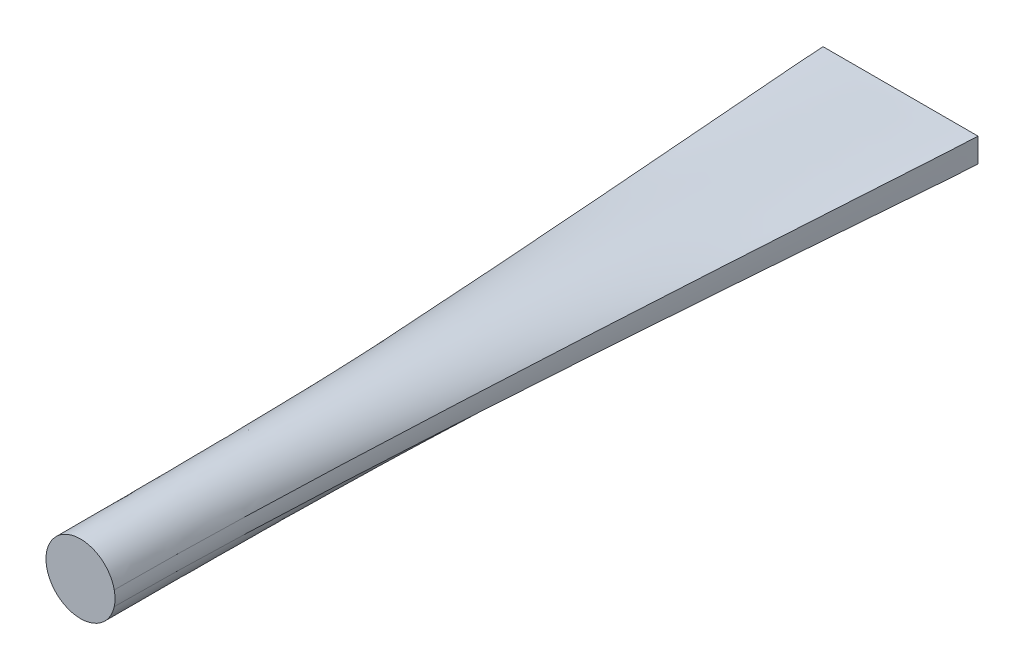
ISO-10303-21;
HEADER;
FILE_DESCRIPTION(('STEP AP214'),'2;1');
FILE_NAME('part.step','',(''),(''),'','','');
FILE_SCHEMA(('AUTOMOTIVE_DESIGN { 1 0 10303 214 1 1 1 1 }'));
ENDSEC;
DATA;
#1=APPLICATION_CONTEXT('core data for automotive mechanical design processes');
#2=APPLICATION_PROTOCOL_DEFINITION('international standard','automotive_design',2000,#1);
#3=PRODUCT_CONTEXT('',#1,'mechanical');
#4=PRODUCT('Part','Part','',(#3));
#5=PRODUCT_RELATED_PRODUCT_CATEGORY('part','',(#4));
#6=PRODUCT_DEFINITION_FORMATION('','',#4);
#7=PRODUCT_DEFINITION_CONTEXT('part definition',#1,'design');
#8=PRODUCT_DEFINITION('design','',#6,#7);
#9=PRODUCT_DEFINITION_SHAPE('','',#8);
#10=(LENGTH_UNIT() NAMED_UNIT(*) SI_UNIT(.MILLI.,.METRE.));
#11=(NAMED_UNIT(*) PLANE_ANGLE_UNIT() SI_UNIT($,.RADIAN.));
#12=(NAMED_UNIT(*) SI_UNIT($,.STERADIAN.) SOLID_ANGLE_UNIT());
#13=UNCERTAINTY_MEASURE_WITH_UNIT(LENGTH_MEASURE(1.E-05),#10,'distance_accuracy_value','');
#14=(GEOMETRIC_REPRESENTATION_CONTEXT(3) GLOBAL_UNCERTAINTY_ASSIGNED_CONTEXT((#13)) GLOBAL_UNIT_ASSIGNED_CONTEXT((#10,
#11,#12)) REPRESENTATION_CONTEXT('',''));
#15=CARTESIAN_POINT('',(0.,0.,0.));
#16=DIRECTION('',(0.,0.,1.));
#17=DIRECTION('',(1.,0.,0.));
#18=AXIS2_PLACEMENT_3D('',#15,#16,#17);
#19=CARTESIAN_POINT('',(0.,0.,0.));
#20=DIRECTION('',(0.,0.,1.));
#21=DIRECTION('',(1.,0.,0.));
#22=AXIS2_PLACEMENT_3D('',#19,#20,#21);
#23=PLANE('',#22);
#24=DIRECTION('',(0.,1.,0.));
#25=VECTOR('',#24,1.);
#26=CARTESIAN_POINT('',(17.,-2.65,0.));
#27=LINE('',#26,#25);
#28=CARTESIAN_POINT('',(17.,-2.65,0.));
#29=VERTEX_POINT('',#28);
#30=CARTESIAN_POINT('',(17.,0.,0.));
#31=VERTEX_POINT('',#30);
#32=EDGE_CURVE('E538',#29,#31,#27,.T.);
#33=ORIENTED_EDGE('',*,*,#32,.F.);
#34=DIRECTION('',(1.,0.,0.));
#35=VECTOR('',#34,1.);
#36=CARTESIAN_POINT('',(17.,-2.65,0.));
#37=LINE('',#36,#35);
#38=CARTESIAN_POINT('',(-17.,-2.65,0.));
#39=VERTEX_POINT('',#38);
#40=EDGE_CURVE('E480',#39,#29,#37,.T.);
#41=ORIENTED_EDGE('',*,*,#40,.F.);
#42=DIRECTION('',(0.,-1.,0.));
#43=VECTOR('',#42,1.);
#44=CARTESIAN_POINT('',(-17.,-2.65,0.));
#45=LINE('',#44,#43);
#46=CARTESIAN_POINT('',(-17.,0.,0.));
#47=VERTEX_POINT('',#46);
#48=EDGE_CURVE('E470',#47,#39,#45,.T.);
#49=ORIENTED_EDGE('',*,*,#48,.F.);
#50=DIRECTION('',(0.,-1.,0.));
#51=VECTOR('',#50,1.);
#52=CARTESIAN_POINT('',(-17.,0.,0.));
#53=LINE('',#52,#51);
#54=CARTESIAN_POINT('',(-17.,2.65,0.));
#55=VERTEX_POINT('',#54);
#56=EDGE_CURVE('E397',#55,#47,#53,.T.);
#57=ORIENTED_EDGE('',*,*,#56,.F.);
#58=DIRECTION('',(-1.,0.,0.));
#59=VECTOR('',#58,1.);
#60=CARTESIAN_POINT('',(17.,2.65,0.));
#61=LINE('',#60,#59);
#62=CARTESIAN_POINT('',(17.,2.65,0.));
#63=VERTEX_POINT('',#62);
#64=EDGE_CURVE('E188',#63,#55,#61,.T.);
#65=ORIENTED_EDGE('',*,*,#64,.F.);
#66=DIRECTION('',(0.,1.,0.));
#67=VECTOR('',#66,1.);
#68=CARTESIAN_POINT('',(17.,0.,0.));
#69=LINE('',#68,#67);
#70=EDGE_CURVE('E193',#31,#63,#69,.T.);
#71=ORIENTED_EDGE('',*,*,#70,.F.);
#72=EDGE_LOOP('',(#33,#41,#49,#57,#65,#71));
#73=FACE_BOUND('',#72,.T.);
#74=ADVANCED_FACE('F145',(#73),#23,.F.);
#75=CARTESIAN_POINT('',(0.,0.,180.));
#76=DIRECTION('',(0.,0.,1.));
#77=DIRECTION('',(1.,0.,0.));
#78=AXIS2_PLACEMENT_3D('',#75,#76,#77);
#79=PLANE('',#78);
#80=CARTESIAN_POINT('',(0.,0.,180.));
#81=DIRECTION('',(0.,0.,1.));
#82=DIRECTION('',(1.,0.,0.));
#83=AXIS2_PLACEMENT_3D('',#80,#81,#82);
#84=CIRCLE('',#83,7.5749);
#85=CARTESIAN_POINT('',(-7.5749,0.,180.));
#86=VERTEX_POINT('',#85);
#87=CARTESIAN_POINT('',(-7.40557206763198,-1.59267459360314,180.));
#88=VERTEX_POINT('',#87);
#89=EDGE_CURVE('E165',#86,#88,#84,.T.);
#90=ORIENTED_EDGE('',*,*,#89,.T.);
#91=CARTESIAN_POINT('',(7.40557206763198,-1.59267459360314,180.));
#92=VERTEX_POINT('',#91);
#93=EDGE_CURVE('E339',#88,#92,#84,.T.);
#94=ORIENTED_EDGE('',*,*,#93,.T.);
#95=CARTESIAN_POINT('',(7.5749,0.,180.));
#96=VERTEX_POINT('',#95);
#97=EDGE_CURVE('E213',#92,#96,#84,.T.);
#98=ORIENTED_EDGE('',*,*,#97,.T.);
#99=CARTESIAN_POINT('',(0.,0.,180.));
#100=DIRECTION('',(0.,0.,1.));
#101=DIRECTION('',(1.,0.,0.));
#102=AXIS2_PLACEMENT_3D('',#99,#100,#101);
#103=CIRCLE('',#102,7.5749);
#104=CARTESIAN_POINT('',(7.40557206763198,1.59267459360315,180.));
#105=VERTEX_POINT('',#104);
#106=EDGE_CURVE('E12',#96,#105,#103,.T.);
#107=ORIENTED_EDGE('',*,*,#106,.T.);
#108=CARTESIAN_POINT('',(-7.40557206763198,1.59267459360315,180.));
#109=VERTEX_POINT('',#108);
#110=EDGE_CURVE('E156',#105,#109,#103,.T.);
#111=ORIENTED_EDGE('',*,*,#110,.T.);
#112=EDGE_CURVE('E227',#109,#86,#103,.T.);
#113=ORIENTED_EDGE('',*,*,#112,.T.);
#114=EDGE_LOOP('',(#90,#94,#98,#107,#111,#113));
#115=FACE_BOUND('',#114,.T.);
#116=ADVANCED_FACE('F210',(#115),#79,.T.);
#117=CARTESIAN_POINT('',(-7.5749,0.,180.));
#118=CARTESIAN_POINT('',(-7.5749,0.,119.917803977468));
#119=CARTESIAN_POINT('',(-17.,0.,6.00821960225323));
#120=CARTESIAN_POINT('',(-17.,0.,0.));
#121=CARTESIAN_POINT('',(-7.5749,0.535378542393357,180.));
#122=CARTESIAN_POINT('',(-7.5749,0.535378542393357,119.916466818692));
#123=CARTESIAN_POINT('',(-17.,0.883333333333329,6.00835331813082));
#124=CARTESIAN_POINT('',(-17.,0.883333333333329,0.));
#125=CARTESIAN_POINT('',(-7.51813907213768,1.06926380545311,180.));
#126=CARTESIAN_POINT('',(-7.51813907213768,1.06926380545311,119.915129659916));
#127=CARTESIAN_POINT('',(-17.,1.76666666666666,6.0084870340084));
#128=CARTESIAN_POINT('',(-17.,1.76666666666666,0.));
#129=CARTESIAN_POINT('',(-7.40557206763198,1.59267459360315,180.));
#130=CARTESIAN_POINT('',(-7.40557206763198,1.59267459360315,119.91379250114));
#131=CARTESIAN_POINT('',(-17.,2.65,6.00862074988599));
#132=CARTESIAN_POINT('',(-17.,2.65,0.));
#133=B_SPLINE_SURFACE_WITH_KNOTS('',3,3,((#117,#118,#119,#120),(#121,#122,#123,#124),(#125,#126,
#127,#128),(#129,#130,#131,#132)),.UNSPECIFIED.,.F.,.F.,.F.,(4,4),(4,4),(0.,1.),(0.,1.),.UNSPECIFIED.);
#134=CARTESIAN_POINT('',(-7.40557206763198,1.59267459360315,180.));
#135=CARTESIAN_POINT('',(-7.40557206763198,1.59267459360315,119.91379250114));
#136=CARTESIAN_POINT('',(-17.,2.65,6.00862074988599));
#137=CARTESIAN_POINT('',(-17.,2.65,0.));
#138=B_SPLINE_CURVE_WITH_KNOTS('',3,(#134,#135,#136,#137),.UNSPECIFIED.,.F.,.F.,(4,4),(0.,1.),.UNSPECIFIED.);
#139=EDGE_CURVE('E225',#109,#55,#138,.T.);
#140=CARTESIAN_POINT('',(-7.5749,0.,180.));
#141=CARTESIAN_POINT('',(-7.5749,0.,119.917803977468));
#142=CARTESIAN_POINT('',(-17.,0.,6.00821960225323));
#143=CARTESIAN_POINT('',(-17.,0.,0.));
#144=B_SPLINE_CURVE_WITH_KNOTS('',3,(#140,#141,#142,#143),.UNSPECIFIED.,.F.,.F.,(4,4),(0.,1.),.UNSPECIFIED.);
#145=EDGE_CURVE('E234',#47,#86,#144,.F.);
#146=ORIENTED_EDGE('',*,*,#112,.F.);
#147=ORIENTED_EDGE('',*,*,#139,.T.);
#148=ORIENTED_EDGE('',*,*,#56,.T.);
#149=ORIENTED_EDGE('',*,*,#145,.T.);
#150=EDGE_LOOP('',(#146,#147,#148,#149));
#151=FACE_BOUND('',#150,.T.);
#152=ADVANCED_FACE('F365',(#151),#133,.T.);
#153=CARTESIAN_POINT('',(-7.40557206763198,1.59267459360315,180.));
#154=CARTESIAN_POINT('',(-7.40557206763198,1.59267459360315,119.91379250114));
#155=CARTESIAN_POINT('',(-17.,2.65,6.00862074988599));
#156=CARTESIAN_POINT('',(-17.,2.65,0.));
#157=CARTESIAN_POINT('',(-6.65529129604221,5.08130833415686,180.));
#158=CARTESIAN_POINT('',(-6.65529129604221,5.08130833415686,119.945669351287));
#159=CARTESIAN_POINT('',(-11.3333333333333,2.65,6.00543306487134));
#160=CARTESIAN_POINT('',(-11.3333333333333,2.65,0.));
#161=CARTESIAN_POINT('',(-3.56840112822917,7.5749,180.));
#162=CARTESIAN_POINT('',(-3.56840112822917,7.5749,119.977546201433));
#163=CARTESIAN_POINT('',(-5.66666666666667,2.65,6.0022453798567));
#164=CARTESIAN_POINT('',(-5.66666666666667,2.65,0.));
#165=CARTESIAN_POINT('',(3.56840112822916,7.5749,180.));
#166=CARTESIAN_POINT('',(3.56840112822916,7.5749,119.977546201433));
#167=CARTESIAN_POINT('',(5.66666666666667,2.65,6.0022453798567));
#168=CARTESIAN_POINT('',(5.66666666666667,2.65,0.));
#169=CARTESIAN_POINT('',(6.65529129604221,5.08130833415687,180.));
#170=CARTESIAN_POINT('',(6.65529129604221,5.08130833415687,119.945669351287));
#171=CARTESIAN_POINT('',(11.3333333333333,2.65,6.00543306487135));
#172=CARTESIAN_POINT('',(11.3333333333333,2.65,0.));
#173=CARTESIAN_POINT('',(7.40557206763198,1.59267459360315,180.));
#174=CARTESIAN_POINT('',(7.40557206763198,1.59267459360315,119.91379250114));
#175=CARTESIAN_POINT('',(17.,2.65,6.00862074988599));
#176=CARTESIAN_POINT('',(17.,2.65,0.));
#177=B_SPLINE_SURFACE_WITH_KNOTS('',3,3,((#153,#154,#155,#156),(#157,#158,#159,#160),(#161,#162,
#163,#164),(#165,#166,#167,#168),(#169,#170,#171,#172),(#173,#174,#175,#176)),.UNSPECIFIED.,.F.,
.F.,.F.,(4,2,4),(4,4),(0.,0.5,1.),(0.,1.),.UNSPECIFIED.);
#178=CARTESIAN_POINT('',(7.40557206763198,1.59267459360315,180.));
#179=CARTESIAN_POINT('',(7.40557206763198,1.59267459360315,119.91379250114));
#180=CARTESIAN_POINT('',(17.,2.65,6.00862074988599));
#181=CARTESIAN_POINT('',(17.,2.65,0.));
#182=B_SPLINE_CURVE_WITH_KNOTS('',3,(#178,#179,#180,#181),.UNSPECIFIED.,.F.,.F.,(4,4),(0.,1.),.UNSPECIFIED.);
#183=EDGE_CURVE('E222',#105,#63,#182,.T.);
#184=ORIENTED_EDGE('',*,*,#110,.F.);
#185=ORIENTED_EDGE('',*,*,#183,.T.);
#186=ORIENTED_EDGE('',*,*,#64,.T.);
#187=ORIENTED_EDGE('',*,*,#139,.F.);
#188=EDGE_LOOP('',(#184,#185,#186,#187));
#189=FACE_BOUND('',#188,.T.);
#190=ADVANCED_FACE('F221',(#189),#177,.T.);
#191=CARTESIAN_POINT('',(-7.40557206763198,-1.59267459360314,180.));
#192=CARTESIAN_POINT('',(-7.40557206763198,-1.59267459360314,119.91379250114));
#193=CARTESIAN_POINT('',(-17.,-2.65,6.00862074988599));
#194=CARTESIAN_POINT('',(-17.,-2.65,0.));
#195=CARTESIAN_POINT('',(-7.51813907213768,-1.0692638054531,180.));
#196=CARTESIAN_POINT('',(-7.51813907213768,-1.0692638054531,119.915129659916));
#197=CARTESIAN_POINT('',(-17.,-1.76666666666667,6.0084870340084));
#198=CARTESIAN_POINT('',(-17.,-1.76666666666667,0.));
#199=CARTESIAN_POINT('',(-7.5749,-0.535378542393354,180.));
#200=CARTESIAN_POINT('',(-7.5749,-0.535378542393354,119.916466818692));
#201=CARTESIAN_POINT('',(-17.,-0.883333333333338,6.00835331813082));
#202=CARTESIAN_POINT('',(-17.,-0.883333333333338,0.));
#203=CARTESIAN_POINT('',(-7.5749,0.,180.));
#204=CARTESIAN_POINT('',(-7.5749,0.,119.917803977468));
#205=CARTESIAN_POINT('',(-17.,0.,6.00821960225323));
#206=CARTESIAN_POINT('',(-17.,0.,0.));
#207=B_SPLINE_SURFACE_WITH_KNOTS('',3,3,((#191,#192,#193,#194),(#195,#196,#197,#198),(#199,#200,
#201,#202),(#203,#204,#205,#206)),.UNSPECIFIED.,.F.,.F.,.F.,(4,4),(4,4),(0.,1.),(0.,1.),.UNSPECIFIED.);
#208=CARTESIAN_POINT('',(-7.40557206763198,-1.59267459360314,180.));
#209=CARTESIAN_POINT('',(-7.40557206763198,-1.59267459360314,119.91379250114));
#210=CARTESIAN_POINT('',(-17.,-2.65,6.00862074988599));
#211=CARTESIAN_POINT('',(-17.,-2.65,0.));
#212=B_SPLINE_CURVE_WITH_KNOTS('',3,(#208,#209,#210,#211),.UNSPECIFIED.,.F.,.F.,(4,4),(0.,1.),.UNSPECIFIED.);
#213=EDGE_CURVE('E319',#88,#39,#212,.T.);
#214=ORIENTED_EDGE('',*,*,#89,.F.);
#215=ORIENTED_EDGE('',*,*,#145,.F.);
#216=ORIENTED_EDGE('',*,*,#48,.T.);
#217=ORIENTED_EDGE('',*,*,#213,.F.);
#218=EDGE_LOOP('',(#214,#215,#216,#217));
#219=FACE_BOUND('',#218,.T.);
#220=ADVANCED_FACE('F258',(#219),#207,.T.);
#221=CARTESIAN_POINT('',(7.40557206763198,1.59267459360315,180.));
#222=CARTESIAN_POINT('',(7.40557206763198,1.59267459360315,119.91379250114));
#223=CARTESIAN_POINT('',(17.,2.65,6.00862074988599));
#224=CARTESIAN_POINT('',(17.,2.65,0.));
#225=CARTESIAN_POINT('',(7.43368777419242,1.46194299783215,180.));
#226=CARTESIAN_POINT('',(7.43368777419242,1.46194299783215,119.914416967117));
#227=CARTESIAN_POINT('',(17.,2.42916666666667,6.00855830328826));
#228=CARTESIAN_POINT('',(17.,2.42916666666667,0.));
#229=CARTESIAN_POINT('',(7.48299425920022,1.19899051457991,180.));
#230=CARTESIAN_POINT('',(7.48299425920022,1.19899051457991,119.915665899072));
#231=CARTESIAN_POINT('',(17.,1.9875,6.00843341009281));
#232=CARTESIAN_POINT('',(17.,1.9875,0.));
#233=CARTESIAN_POINT('',(7.53597094972639,0.801199682865396,180.));
#234=CARTESIAN_POINT('',(7.53597094972639,0.801199682865396,119.916885950542));
#235=CARTESIAN_POINT('',(17.,1.325,6.00831140494575));
#236=CARTESIAN_POINT('',(17.,1.325,0.));
#237=CARTESIAN_POINT('',(7.56781673668645,0.401162282878682,180.));
#238=CARTESIAN_POINT('',(7.56781673668645,0.401162282878682,119.917640349176));
#239=CARTESIAN_POINT('',(17.,0.662499999999993,6.00823596508238));
#240=CARTESIAN_POINT('',(17.,0.662499999999993,0.));
#241=CARTESIAN_POINT('',(7.5749,0.133720765359103,180.));
#242=CARTESIAN_POINT('',(7.5749,0.133720765359103,119.917803977468));
#243=CARTESIAN_POINT('',(17.,0.220833333333327,6.00821960225323));
#244=CARTESIAN_POINT('',(17.,0.220833333333327,0.));
#245=CARTESIAN_POINT('',(7.5749,-0.133720765359103,180.));
#246=CARTESIAN_POINT('',(7.5749,-0.133720765359103,119.917803977468));
#247=CARTESIAN_POINT('',(17.,-0.22083333333334,6.00821960225323));
#248=CARTESIAN_POINT('',(17.,-0.22083333333334,0.));
#249=CARTESIAN_POINT('',(7.56781673668645,-0.401162282878682,180.));
#250=CARTESIAN_POINT('',(7.56781673668645,-0.401162282878682,119.917640349176));
#251=CARTESIAN_POINT('',(17.,-0.662500000000005,6.00823596508239));
#252=CARTESIAN_POINT('',(17.,-0.662500000000005,0.));
#253=CARTESIAN_POINT('',(7.53597094972639,-0.80119968286539,180.));
#254=CARTESIAN_POINT('',(7.53597094972639,-0.80119968286539,119.916885950542));
#255=CARTESIAN_POINT('',(17.,-1.325,6.00831140494575));
#256=CARTESIAN_POINT('',(17.,-1.325,0.));
#257=CARTESIAN_POINT('',(7.48299425920022,-1.1989905145799,180.));
#258=CARTESIAN_POINT('',(7.48299425920022,-1.1989905145799,119.915665899072));
#259=CARTESIAN_POINT('',(17.,-1.9875,6.00843341009281));
#260=CARTESIAN_POINT('',(17.,-1.9875,0.));
#261=CARTESIAN_POINT('',(7.43368777419242,-1.46194299783214,180.));
#262=CARTESIAN_POINT('',(7.43368777419242,-1.46194299783214,119.914416967117));
#263=CARTESIAN_POINT('',(17.,-2.42916666666667,6.00855830328826));
#264=CARTESIAN_POINT('',(17.,-2.42916666666667,0.));
#265=CARTESIAN_POINT('',(7.40557206763198,-1.59267459360314,180.));
#266=CARTESIAN_POINT('',(7.40557206763198,-1.59267459360314,119.91379250114));
#267=CARTESIAN_POINT('',(17.,-2.65,6.00862074988599));
#268=CARTESIAN_POINT('',(17.,-2.65,0.));
#269=B_SPLINE_SURFACE_WITH_KNOTS('',3,3,((#221,#222,#223,#224),(#225,#226,#227,#228),(#229,#230,
#231,#232),(#233,#234,#235,#236),(#237,#238,#239,#240),(#241,#242,#243,#244),(#245,#246,#247,
#248),(#249,#250,#251,#252),(#253,#254,#255,#256),(#257,#258,#259,#260),(#261,#262,#263,#264),
(#265,#266,#267,#268)),.UNSPECIFIED.,.F.,.F.,.F.,(4,1,1,1,2,1,1,1,4),(4,4),(0.,0.125,
0.250000000000001,0.375000000000001,0.500000000000001,0.625000000000001,0.750000000000001,0.875,
1.),(0.,1.),.UNSPECIFIED.);
#270=CARTESIAN_POINT('',(7.40557206763198,-1.59267459360314,180.));
#271=CARTESIAN_POINT('',(7.40557206763198,-1.59267459360314,119.91379250114));
#272=CARTESIAN_POINT('',(17.,-2.65,6.00862074988599));
#273=CARTESIAN_POINT('',(17.,-2.65,0.));
#274=B_SPLINE_CURVE_WITH_KNOTS('',3,(#270,#271,#272,#273),.UNSPECIFIED.,.F.,.F.,(4,4),(0.,1.),.UNSPECIFIED.);
#275=EDGE_CURVE('E235',#92,#29,#274,.T.);
#276=ORIENTED_EDGE('',*,*,#106,.F.);
#277=ORIENTED_EDGE('',*,*,#97,.F.);
#278=ORIENTED_EDGE('',*,*,#275,.T.);
#279=ORIENTED_EDGE('',*,*,#32,.T.);
#280=ORIENTED_EDGE('',*,*,#70,.T.);
#281=ORIENTED_EDGE('',*,*,#183,.F.);
#282=EDGE_LOOP('',(#276,#277,#278,#279,#280,#281));
#283=FACE_BOUND('',#282,.T.);
#284=ADVANCED_FACE('F232',(#283),#269,.T.);
#285=CARTESIAN_POINT('',(7.40557206763198,-1.59267459360314,180.));
#286=CARTESIAN_POINT('',(7.40557206763198,-1.59267459360314,119.91379250114));
#287=CARTESIAN_POINT('',(17.,-2.65,6.00862074988599));
#288=CARTESIAN_POINT('',(17.,-2.65,0.));
#289=CARTESIAN_POINT('',(6.65529129604221,-5.08130833415686,180.));
#290=CARTESIAN_POINT('',(6.65529129604221,-5.08130833415686,119.945669351287));
#291=CARTESIAN_POINT('',(11.3333333333333,-2.65,6.00543306487134));
#292=CARTESIAN_POINT('',(11.3333333333333,-2.65,0.));
#293=CARTESIAN_POINT('',(3.56840112822917,-7.5749,180.));
#294=CARTESIAN_POINT('',(3.56840112822917,-7.5749,119.977546201433));
#295=CARTESIAN_POINT('',(5.66666666666666,-2.65,6.0022453798567));
#296=CARTESIAN_POINT('',(5.66666666666666,-2.65,0.));
#297=CARTESIAN_POINT('',(-3.56840112822917,-7.5749,180.));
#298=CARTESIAN_POINT('',(-3.56840112822917,-7.5749,119.977546201433));
#299=CARTESIAN_POINT('',(-5.66666666666667,-2.65,6.0022453798567));
#300=CARTESIAN_POINT('',(-5.66666666666667,-2.65,0.));
#301=CARTESIAN_POINT('',(-6.65529129604221,-5.08130833415686,180.));
#302=CARTESIAN_POINT('',(-6.65529129604221,-5.08130833415686,119.945669351287));
#303=CARTESIAN_POINT('',(-11.3333333333333,-2.65,6.00543306487134));
#304=CARTESIAN_POINT('',(-11.3333333333333,-2.65,0.));
#305=CARTESIAN_POINT('',(-7.40557206763198,-1.59267459360314,180.));
#306=CARTESIAN_POINT('',(-7.40557206763198,-1.59267459360314,119.91379250114));
#307=CARTESIAN_POINT('',(-17.,-2.65,6.00862074988599));
#308=CARTESIAN_POINT('',(-17.,-2.65,0.));
#309=B_SPLINE_SURFACE_WITH_KNOTS('',3,3,((#285,#286,#287,#288),(#289,#290,#291,#292),(#293,#294,
#295,#296),(#297,#298,#299,#300),(#301,#302,#303,#304),(#305,#306,#307,#308)),.UNSPECIFIED.,.F.,
.F.,.F.,(4,2,4),(4,4),(0.,0.5,1.),(0.,1.),.UNSPECIFIED.);
#310=ORIENTED_EDGE('',*,*,#93,.F.);
#311=ORIENTED_EDGE('',*,*,#213,.T.);
#312=ORIENTED_EDGE('',*,*,#40,.T.);
#313=ORIENTED_EDGE('',*,*,#275,.F.);
#314=EDGE_LOOP('',(#310,#311,#312,#313));
#315=FACE_BOUND('',#314,.T.);
#316=ADVANCED_FACE('F257',(#315),#309,.T.);
#317=CLOSED_SHELL('',(#74,#116,#152,#190,#220,#284,#316));
#318=MANIFOLD_SOLID_BREP('B2',#317);
#319=ADVANCED_BREP_SHAPE_REPRESENTATION('',(#18,#318),#14);
#320=SHAPE_DEFINITION_REPRESENTATION(#9,#319);
ENDSEC;
END-ISO-10303-21;
